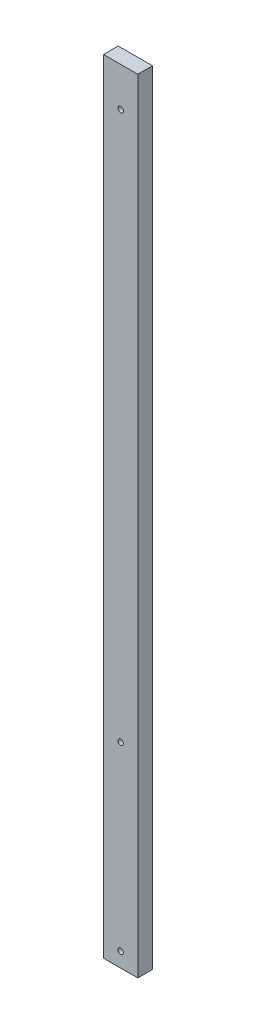
ISO-10303-21;
HEADER;
FILE_DESCRIPTION(('STEP AP214'),'2;1');
FILE_NAME('part.step','',(''),(''),'','','');
FILE_SCHEMA(('AUTOMOTIVE_DESIGN { 1 0 10303 214 1 1 1 1 }'));
ENDSEC;
DATA;
#1=APPLICATION_CONTEXT('core data for automotive mechanical design processes');
#2=APPLICATION_PROTOCOL_DEFINITION('international standard','automotive_design',2000,#1);
#3=PRODUCT_CONTEXT('',#1,'mechanical');
#4=PRODUCT('Part','Part','',(#3));
#5=PRODUCT_RELATED_PRODUCT_CATEGORY('part','',(#4));
#6=PRODUCT_DEFINITION_FORMATION('','',#4);
#7=PRODUCT_DEFINITION_CONTEXT('part definition',#1,'design');
#8=PRODUCT_DEFINITION('design','',#6,#7);
#9=PRODUCT_DEFINITION_SHAPE('','',#8);
#10=(LENGTH_UNIT() NAMED_UNIT(*) SI_UNIT(.MILLI.,.METRE.));
#11=(NAMED_UNIT(*) PLANE_ANGLE_UNIT() SI_UNIT($,.RADIAN.));
#12=(NAMED_UNIT(*) SI_UNIT($,.STERADIAN.) SOLID_ANGLE_UNIT());
#13=UNCERTAINTY_MEASURE_WITH_UNIT(LENGTH_MEASURE(1.E-05),#10,'distance_accuracy_value','');
#14=(GEOMETRIC_REPRESENTATION_CONTEXT(3) GLOBAL_UNCERTAINTY_ASSIGNED_CONTEXT((#13)) GLOBAL_UNIT_ASSIGNED_CONTEXT((#10,
#11,#12)) REPRESENTATION_CONTEXT('',''));
#15=CARTESIAN_POINT('',(0.,0.,0.));
#16=DIRECTION('',(0.,0.,1.));
#17=DIRECTION('',(1.,0.,0.));
#18=AXIS2_PLACEMENT_3D('',#15,#16,#17);
#19=CARTESIAN_POINT('',(-44.45,2032.,19.05));
#20=DIRECTION('',(-1.,0.,0.));
#21=DIRECTION('',(0.,0.,1.));
#22=AXIS2_PLACEMENT_3D('',#19,#20,#21);
#23=PLANE('',#22);
#24=DIRECTION('',(0.,0.,-1.));
#25=VECTOR('',#24,1.);
#26=CARTESIAN_POINT('',(-44.45,0.,19.05));
#27=LINE('',#26,#25);
#28=CARTESIAN_POINT('',(-44.45,0.,19.05));
#29=VERTEX_POINT('',#28);
#30=CARTESIAN_POINT('',(-44.45,0.,-19.05));
#31=VERTEX_POINT('',#30);
#32=EDGE_CURVE('E107',#29,#31,#27,.T.);
#33=ORIENTED_EDGE('',*,*,#32,.F.);
#34=DIRECTION('',(0.,-1.,0.));
#35=VECTOR('',#34,1.);
#36=CARTESIAN_POINT('',(-44.45,2032.,19.05));
#37=LINE('',#36,#35);
#38=CARTESIAN_POINT('',(-44.45,2032.,19.05));
#39=VERTEX_POINT('',#38);
#40=EDGE_CURVE('E11',#39,#29,#37,.T.);
#41=ORIENTED_EDGE('',*,*,#40,.F.);
#42=DIRECTION('',(0.,0.,-1.));
#43=VECTOR('',#42,1.);
#44=CARTESIAN_POINT('',(-44.45,2032.,19.05));
#45=LINE('',#44,#43);
#46=CARTESIAN_POINT('',(-44.45,2032.,-19.05));
#47=VERTEX_POINT('',#46);
#48=EDGE_CURVE('E101',#39,#47,#45,.T.);
#49=ORIENTED_EDGE('',*,*,#48,.T.);
#50=DIRECTION('',(0.,-1.,0.));
#51=VECTOR('',#50,1.);
#52=CARTESIAN_POINT('',(-44.45,2032.,-19.05));
#53=LINE('',#52,#51);
#54=EDGE_CURVE('E44',#47,#31,#53,.T.);
#55=ORIENTED_EDGE('',*,*,#54,.T.);
#56=EDGE_LOOP('',(#33,#41,#49,#55));
#57=FACE_BOUND('',#56,.T.);
#58=ADVANCED_FACE('F41',(#57),#23,.T.);
#59=CARTESIAN_POINT('',(-44.45,2032.,19.05));
#60=DIRECTION('',(0.,0.,-1.));
#61=DIRECTION('',(-1.,0.,0.));
#62=AXIS2_PLACEMENT_3D('',#59,#60,#61);
#63=PLANE('',#62);
#64=CARTESIAN_POINT('',(2.44182325281991E-13,38.1,19.05));
#65=DIRECTION('',(0.,0.,-1.));
#66=DIRECTION('',(-1.,0.,0.));
#67=AXIS2_PLACEMENT_3D('',#64,#65,#66);
#68=CIRCLE('',#67,7.14375);
#69=CARTESIAN_POINT('',(-7.14374999999976,38.1,19.05));
#70=VERTEX_POINT('',#69);
#71=EDGE_CURVE('E111',#70,#70,#68,.T.);
#72=ORIENTED_EDGE('',*,*,#71,.T.);
#73=EDGE_LOOP('',(#72));
#74=FACE_BOUND('',#73,.T.);
#75=CARTESIAN_POINT('',(1.86636172190057E-13,508.,19.05));
#76=DIRECTION('',(0.,0.,-1.));
#77=DIRECTION('',(-1.,0.,0.));
#78=AXIS2_PLACEMENT_3D('',#75,#76,#77);
#79=CIRCLE('',#78,7.14374999999999);
#80=CARTESIAN_POINT('',(-7.1437499999998,508.,19.05));
#81=VERTEX_POINT('',#80);
#82=EDGE_CURVE('E156',#81,#81,#79,.T.);
#83=ORIENTED_EDGE('',*,*,#82,.T.);
#84=EDGE_LOOP('',(#83));
#85=FACE_BOUND('',#84,.T.);
#86=CARTESIAN_POINT('',(0.,1930.4,19.05));
#87=DIRECTION('',(0.,0.,-1.));
#88=DIRECTION('',(-1.,0.,0.));
#89=AXIS2_PLACEMENT_3D('',#86,#87,#88);
#90=CIRCLE('',#89,7.14375000000002);
#91=CARTESIAN_POINT('',(-7.14375000000001,1930.4,19.05));
#92=VERTEX_POINT('',#91);
#93=EDGE_CURVE('E153',#92,#92,#90,.T.);
#94=ORIENTED_EDGE('',*,*,#93,.T.);
#95=EDGE_LOOP('',(#94));
#96=FACE_BOUND('',#95,.T.);
#97=DIRECTION('',(1.,0.,0.));
#98=VECTOR('',#97,1.);
#99=CARTESIAN_POINT('',(-44.45,0.,19.05));
#100=LINE('',#99,#98);
#101=CARTESIAN_POINT('',(44.45,0.,19.05));
#102=VERTEX_POINT('',#101);
#103=EDGE_CURVE('E74',#29,#102,#100,.T.);
#104=ORIENTED_EDGE('',*,*,#103,.T.);
#105=DIRECTION('',(0.,-1.,0.));
#106=VECTOR('',#105,1.);
#107=CARTESIAN_POINT('',(44.45,2032.,19.05));
#108=LINE('',#107,#106);
#109=CARTESIAN_POINT('',(44.45,2032.,19.05));
#110=VERTEX_POINT('',#109);
#111=EDGE_CURVE('E50',#110,#102,#108,.T.);
#112=ORIENTED_EDGE('',*,*,#111,.F.);
#113=DIRECTION('',(1.,0.,0.));
#114=VECTOR('',#113,1.);
#115=CARTESIAN_POINT('',(-44.45,2032.,19.05));
#116=LINE('',#115,#114);
#117=EDGE_CURVE('E91',#39,#110,#116,.T.);
#118=ORIENTED_EDGE('',*,*,#117,.F.);
#119=ORIENTED_EDGE('',*,*,#40,.T.);
#120=EDGE_LOOP('',(#104,#112,#118,#119));
#121=FACE_BOUND('',#120,.T.);
#122=ADVANCED_FACE('F118',(#74,#85,#96,#121),#63,.F.);
#123=CARTESIAN_POINT('',(44.45,2032.,19.05));
#124=DIRECTION('',(-1.,0.,0.));
#125=DIRECTION('',(0.,0.,1.));
#126=AXIS2_PLACEMENT_3D('',#123,#124,#125);
#127=PLANE('',#126);
#128=DIRECTION('',(0.,0.,-1.));
#129=VECTOR('',#128,1.);
#130=CARTESIAN_POINT('',(44.45,0.,19.05));
#131=LINE('',#130,#129);
#132=CARTESIAN_POINT('',(44.45,0.,-19.05));
#133=VERTEX_POINT('',#132);
#134=EDGE_CURVE('E98',#102,#133,#131,.T.);
#135=ORIENTED_EDGE('',*,*,#134,.T.);
#136=DIRECTION('',(0.,-1.,0.));
#137=VECTOR('',#136,1.);
#138=CARTESIAN_POINT('',(44.45,2032.,-19.05));
#139=LINE('',#138,#137);
#140=CARTESIAN_POINT('',(44.45,2032.,-19.05));
#141=VERTEX_POINT('',#140);
#142=EDGE_CURVE('E95',#141,#133,#139,.T.);
#143=ORIENTED_EDGE('',*,*,#142,.F.);
#144=DIRECTION('',(0.,0.,-1.));
#145=VECTOR('',#144,1.);
#146=CARTESIAN_POINT('',(44.45,2032.,19.05));
#147=LINE('',#146,#145);
#148=EDGE_CURVE('E86',#110,#141,#147,.T.);
#149=ORIENTED_EDGE('',*,*,#148,.F.);
#150=ORIENTED_EDGE('',*,*,#111,.T.);
#151=EDGE_LOOP('',(#135,#143,#149,#150));
#152=FACE_BOUND('',#151,.T.);
#153=ADVANCED_FACE('F96',(#152),#127,.F.);
#154=CARTESIAN_POINT('',(-44.45,2032.,-19.05));
#155=DIRECTION('',(0.,0.,-1.));
#156=DIRECTION('',(-1.,0.,0.));
#157=AXIS2_PLACEMENT_3D('',#154,#155,#156);
#158=PLANE('',#157);
#159=CARTESIAN_POINT('',(2.44182325281991E-13,38.1,-19.05));
#160=DIRECTION('',(0.,0.,1.));
#161=DIRECTION('',(1.,0.,0.));
#162=AXIS2_PLACEMENT_3D('',#159,#160,#161);
#163=CIRCLE('',#162,7.14375);
#164=CARTESIAN_POINT('',(7.14375000000024,38.1,-19.05));
#165=VERTEX_POINT('',#164);
#166=EDGE_CURVE('E140',#165,#165,#163,.T.);
#167=ORIENTED_EDGE('',*,*,#166,.T.);
#168=EDGE_LOOP('',(#167));
#169=FACE_BOUND('',#168,.T.);
#170=CARTESIAN_POINT('',(1.86636172190057E-13,508.,-19.05));
#171=DIRECTION('',(0.,0.,1.));
#172=DIRECTION('',(1.,0.,0.));
#173=AXIS2_PLACEMENT_3D('',#170,#171,#172);
#174=CIRCLE('',#173,7.14374999999999);
#175=CARTESIAN_POINT('',(7.14375000000018,508.,-19.05));
#176=VERTEX_POINT('',#175);
#177=EDGE_CURVE('E144',#176,#176,#174,.T.);
#178=ORIENTED_EDGE('',*,*,#177,.T.);
#179=EDGE_LOOP('',(#178));
#180=FACE_BOUND('',#179,.T.);
#181=CARTESIAN_POINT('',(0.,1930.4,-19.05));
#182=DIRECTION('',(0.,0.,1.));
#183=DIRECTION('',(1.,0.,0.));
#184=AXIS2_PLACEMENT_3D('',#181,#182,#183);
#185=CIRCLE('',#184,7.14375000000002);
#186=CARTESIAN_POINT('',(7.14375000000003,1930.4,-19.05));
#187=VERTEX_POINT('',#186);
#188=EDGE_CURVE('E147',#187,#187,#185,.T.);
#189=ORIENTED_EDGE('',*,*,#188,.T.);
#190=EDGE_LOOP('',(#189));
#191=FACE_BOUND('',#190,.T.);
#192=DIRECTION('',(1.,0.,0.));
#193=VECTOR('',#192,1.);
#194=CARTESIAN_POINT('',(-44.45,0.,-19.05));
#195=LINE('',#194,#193);
#196=EDGE_CURVE('E110',#31,#133,#195,.T.);
#197=ORIENTED_EDGE('',*,*,#196,.F.);
#198=ORIENTED_EDGE('',*,*,#54,.F.);
#199=DIRECTION('',(1.,0.,0.));
#200=VECTOR('',#199,1.);
#201=CARTESIAN_POINT('',(-44.45,2032.,-19.05));
#202=LINE('',#201,#200);
#203=EDGE_CURVE('E90',#47,#141,#202,.T.);
#204=ORIENTED_EDGE('',*,*,#203,.T.);
#205=ORIENTED_EDGE('',*,*,#142,.T.);
#206=EDGE_LOOP('',(#197,#198,#204,#205));
#207=FACE_BOUND('',#206,.T.);
#208=ADVANCED_FACE('F100',(#169,#180,#191,#207),#158,.T.);
#209=CARTESIAN_POINT('',(0.,2032.,0.));
#210=DIRECTION('',(0.,-1.,0.));
#211=DIRECTION('',(0.,0.,-1.));
#212=AXIS2_PLACEMENT_3D('',#209,#210,#211);
#213=PLANE('',#212);
#214=ORIENTED_EDGE('',*,*,#48,.F.);
#215=ORIENTED_EDGE('',*,*,#117,.T.);
#216=ORIENTED_EDGE('',*,*,#148,.T.);
#217=ORIENTED_EDGE('',*,*,#203,.F.);
#218=EDGE_LOOP('',(#214,#215,#216,#217));
#219=FACE_BOUND('',#218,.T.);
#220=ADVANCED_FACE('F89',(#219),#213,.F.);
#221=CARTESIAN_POINT('',(0.,0.,0.));
#222=DIRECTION('',(0.,-1.,0.));
#223=DIRECTION('',(0.,0.,-1.));
#224=AXIS2_PLACEMENT_3D('',#221,#222,#223);
#225=PLANE('',#224);
#226=ORIENTED_EDGE('',*,*,#32,.T.);
#227=ORIENTED_EDGE('',*,*,#196,.T.);
#228=ORIENTED_EDGE('',*,*,#134,.F.);
#229=ORIENTED_EDGE('',*,*,#103,.F.);
#230=EDGE_LOOP('',(#226,#227,#228,#229));
#231=FACE_BOUND('',#230,.T.);
#232=ADVANCED_FACE('F116',(#231),#225,.T.);
#233=CARTESIAN_POINT('',(0.,1930.4,-19.05));
#234=DIRECTION('',(0.,0.,1.));
#235=DIRECTION('',(1.,0.,0.));
#236=AXIS2_PLACEMENT_3D('',#233,#234,#235);
#237=CYLINDRICAL_SURFACE('',#236,7.14375000000002);
#238=ORIENTED_EDGE('',*,*,#188,.F.);
#239=EDGE_LOOP('',(#238));
#240=FACE_BOUND('',#239,.T.);
#241=ORIENTED_EDGE('',*,*,#93,.F.);
#242=EDGE_LOOP('',(#241));
#243=FACE_BOUND('',#242,.T.);
#244=ADVANCED_FACE('F168',(#240,#243),#237,.F.);
#245=CARTESIAN_POINT('',(1.86636172190057E-13,508.,-19.05));
#246=DIRECTION('',(0.,0.,1.));
#247=DIRECTION('',(1.,0.,0.));
#248=AXIS2_PLACEMENT_3D('',#245,#246,#247);
#249=CYLINDRICAL_SURFACE('',#248,7.14374999999999);
#250=ORIENTED_EDGE('',*,*,#177,.F.);
#251=EDGE_LOOP('',(#250));
#252=FACE_BOUND('',#251,.T.);
#253=ORIENTED_EDGE('',*,*,#82,.F.);
#254=EDGE_LOOP('',(#253));
#255=FACE_BOUND('',#254,.T.);
#256=ADVANCED_FACE('F162',(#252,#255),#249,.F.);
#257=CARTESIAN_POINT('',(2.44182325281991E-13,38.1,-19.05));
#258=DIRECTION('',(0.,0.,1.));
#259=DIRECTION('',(1.,0.,0.));
#260=AXIS2_PLACEMENT_3D('',#257,#258,#259);
#261=CYLINDRICAL_SURFACE('',#260,7.14375);
#262=ORIENTED_EDGE('',*,*,#166,.F.);
#263=EDGE_LOOP('',(#262));
#264=FACE_BOUND('',#263,.T.);
#265=ORIENTED_EDGE('',*,*,#71,.F.);
#266=EDGE_LOOP('',(#265));
#267=FACE_BOUND('',#266,.T.);
#268=ADVANCED_FACE('F160',(#264,#267),#261,.F.);
#269=CLOSED_SHELL('',(#58,#122,#153,#208,#220,#232,#244,#256,#268));
#270=MANIFOLD_SOLID_BREP('B2',#269);
#271=ADVANCED_BREP_SHAPE_REPRESENTATION('',(#18,#270),#14);
#272=SHAPE_DEFINITION_REPRESENTATION(#9,#271);
ENDSEC;
END-ISO-10303-21;
